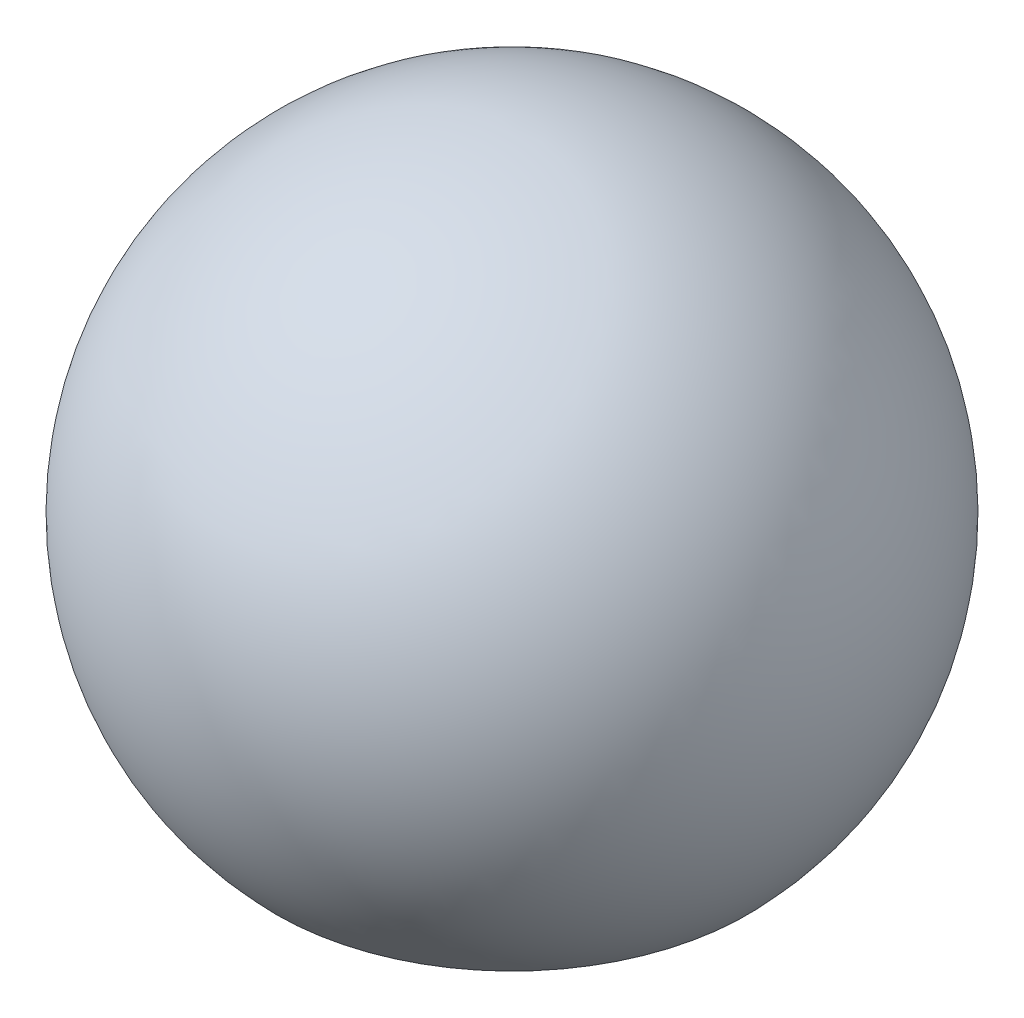
ISO-10303-21;
HEADER;
FILE_DESCRIPTION(('STEP AP214'),'2;1');
FILE_NAME('part.step','',(''),(''),'','','');
FILE_SCHEMA(('AUTOMOTIVE_DESIGN { 1 0 10303 214 1 1 1 1 }'));
ENDSEC;
DATA;
#1=APPLICATION_CONTEXT('core data for automotive mechanical design processes');
#2=APPLICATION_PROTOCOL_DEFINITION('international standard','automotive_design',2000,#1);
#3=PRODUCT_CONTEXT('',#1,'mechanical');
#4=PRODUCT('Part','Part','',(#3));
#5=PRODUCT_RELATED_PRODUCT_CATEGORY('part','',(#4));
#6=PRODUCT_DEFINITION_FORMATION('','',#4);
#7=PRODUCT_DEFINITION_CONTEXT('part definition',#1,'design');
#8=PRODUCT_DEFINITION('design','',#6,#7);
#9=PRODUCT_DEFINITION_SHAPE('','',#8);
#10=(LENGTH_UNIT() NAMED_UNIT(*) SI_UNIT(.MILLI.,.METRE.));
#11=(NAMED_UNIT(*) PLANE_ANGLE_UNIT() SI_UNIT($,.RADIAN.));
#12=(NAMED_UNIT(*) SI_UNIT($,.STERADIAN.) SOLID_ANGLE_UNIT());
#13=UNCERTAINTY_MEASURE_WITH_UNIT(LENGTH_MEASURE(1.E-05),#10,'distance_accuracy_value','');
#14=(GEOMETRIC_REPRESENTATION_CONTEXT(3) GLOBAL_UNCERTAINTY_ASSIGNED_CONTEXT((#13)) GLOBAL_UNIT_ASSIGNED_CONTEXT((#10,
#11,#12)) REPRESENTATION_CONTEXT('',''));
#15=CARTESIAN_POINT('',(0.,0.,0.));
#16=DIRECTION('',(0.,0.,1.));
#17=DIRECTION('',(1.,0.,0.));
#18=AXIS2_PLACEMENT_3D('',#15,#16,#17);
#19=CARTESIAN_POINT('',(31.5003616853772,-10.,-84.2412799222699));
#20=DIRECTION('',(0.,1.,0.));
#21=DIRECTION('',(0.,0.,1.));
#22=AXIS2_PLACEMENT_3D('',#19,#20,#21);
#23=CYLINDRICAL_SURFACE('',#22,0.947350232493906);
#24=CARTESIAN_POINT('',(31.5003616853772,0.,-84.2412799222699));
#25=DIRECTION('',(0.,1.,0.));
#26=DIRECTION('',(0.,0.,1.));
#27=AXIS2_PLACEMENT_3D('',#24,#25,#26);
#28=CIRCLE('',#27,0.947350232493906);
#29=CARTESIAN_POINT('',(31.5003616853772,0.,-83.293929689776));
#30=VERTEX_POINT('',#29);
#31=EDGE_CURVE('E10',#30,#30,#28,.T.);
#32=ORIENTED_EDGE('',*,*,#31,.T.);
#33=EDGE_LOOP('',(#32));
#34=FACE_BOUND('',#33,.T.);
#35=CARTESIAN_POINT('',(31.5003616853772,-2.8,-84.2412799222699));
#36=DIRECTION('',(0.,-1.,0.));
#37=DIRECTION('',(0.,0.,-1.));
#38=AXIS2_PLACEMENT_3D('',#35,#36,#37);
#39=CIRCLE('',#38,0.947350232493906);
#40=CARTESIAN_POINT('',(31.5003616853772,-2.8,-85.1886301547639));
#41=VERTEX_POINT('',#40);
#42=EDGE_CURVE('E35',#41,#41,#39,.F.);
#43=ORIENTED_EDGE('',*,*,#42,.F.);
#44=EDGE_LOOP('',(#43));
#45=FACE_BOUND('',#44,.T.);
#46=ADVANCED_FACE('F31',(#34,#45),#23,.F.);
#47=CARTESIAN_POINT('',(31.5003616853772,0.,-84.2412799222699));
#48=DIRECTION('',(0.,1.,0.));
#49=DIRECTION('',(0.,0.,1.));
#50=AXIS2_PLACEMENT_3D('',#47,#48,#49);
#51=PLANE('',#50);
#52=ORIENTED_EDGE('',*,*,#31,.F.);
#53=EDGE_LOOP('',(#52));
#54=FACE_BOUND('',#53,.T.);
#55=ADVANCED_FACE('F52',(#54),#51,.F.);
#56=CARTESIAN_POINT('',(31.5003616853772,-2.8,-84.2412799222699));
#57=DIRECTION('',(0.,-1.,0.));
#58=DIRECTION('',(0.,0.,-1.));
#59=AXIS2_PLACEMENT_3D('',#56,#57,#58);
#60=PLANE('',#59);
#61=CARTESIAN_POINT('',(31.5003616853772,-2.8,-84.2412799222699));
#62=DIRECTION('',(0.,-1.,0.));
#63=DIRECTION('',(0.,0.,-1.));
#64=AXIS2_PLACEMENT_3D('',#61,#62,#63);
#65=CIRCLE('',#64,2.85657137141715);
#66=CARTESIAN_POINT('',(31.5003616853772,-2.8,-87.0978512936871));
#67=VERTEX_POINT('',#66);
#68=EDGE_CURVE('E39',#67,#67,#65,.F.);
#69=ORIENTED_EDGE('',*,*,#68,.F.);
#70=EDGE_LOOP('',(#69));
#71=FACE_BOUND('',#70,.T.);
#72=ORIENTED_EDGE('',*,*,#42,.T.);
#73=EDGE_LOOP('',(#72));
#74=FACE_BOUND('',#73,.T.);
#75=ADVANCED_FACE('F49',(#71,#74),#60,.T.);
#76=CARTESIAN_POINT('',(31.5003616853772,0.,-84.2412799222699));
#77=DIRECTION('',(0.,0.,-1.));
#78=DIRECTION('',(1.,0.,0.));
#79=AXIS2_PLACEMENT_3D('',#76,#77,#78);
#80=SPHERICAL_SURFACE('',#79,4.);
#81=CARTESIAN_POINT('',(31.5003616853772,0.,-84.2412799222699));
#82=DIRECTION('',(0.,-1.,0.));
#83=DIRECTION('',(0.,0.,-1.));
#84=AXIS2_PLACEMENT_3D('',#81,#82,#83);
#85=SPHERICAL_SURFACE('',#84,4.);
#86=ORIENTED_EDGE('',*,*,#68,.T.);
#87=EDGE_LOOP('',(#86));
#88=FACE_BOUND('',#87,.T.);
#89=ADVANCED_FACE('F33',(#88),#85,.T.);
#90=CLOSED_SHELL('',(#46,#55,#75,#89));
#91=MANIFOLD_SOLID_BREP('B2',#90);
#92=ADVANCED_BREP_SHAPE_REPRESENTATION('',(#18,#91),#14);
#93=SHAPE_DEFINITION_REPRESENTATION(#9,#92);
ENDSEC;
END-ISO-10303-21;
